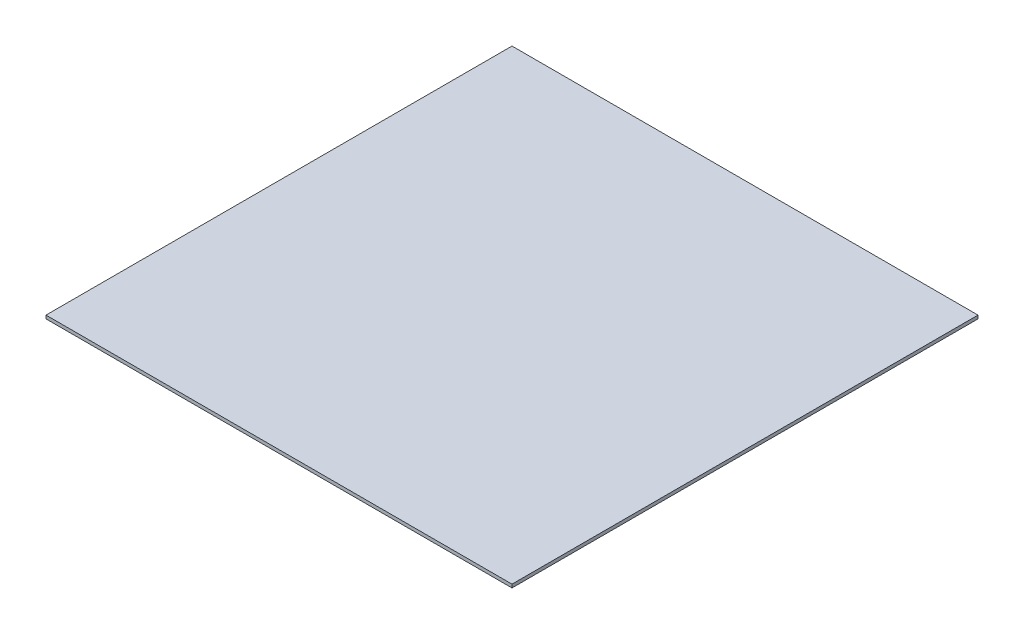
ISO-10303-21;
HEADER;
FILE_DESCRIPTION(('STEP AP214'),'2;1');
FILE_NAME('part.step','',(''),(''),'','','');
FILE_SCHEMA(('AUTOMOTIVE_DESIGN { 1 0 10303 214 1 1 1 1 }'));
ENDSEC;
DATA;
#1=APPLICATION_CONTEXT('core data for automotive mechanical design processes');
#2=APPLICATION_PROTOCOL_DEFINITION('international standard','automotive_design',2000,#1);
#3=PRODUCT_CONTEXT('',#1,'mechanical');
#4=PRODUCT('Part','Part','',(#3));
#5=PRODUCT_RELATED_PRODUCT_CATEGORY('part','',(#4));
#6=PRODUCT_DEFINITION_FORMATION('','',#4);
#7=PRODUCT_DEFINITION_CONTEXT('part definition',#1,'design');
#8=PRODUCT_DEFINITION('design','',#6,#7);
#9=PRODUCT_DEFINITION_SHAPE('','',#8);
#10=(LENGTH_UNIT() NAMED_UNIT(*) SI_UNIT(.MILLI.,.METRE.));
#11=(NAMED_UNIT(*) PLANE_ANGLE_UNIT() SI_UNIT($,.RADIAN.));
#12=(NAMED_UNIT(*) SI_UNIT($,.STERADIAN.) SOLID_ANGLE_UNIT());
#13=UNCERTAINTY_MEASURE_WITH_UNIT(LENGTH_MEASURE(1.E-05),#10,'distance_accuracy_value','');
#14=(GEOMETRIC_REPRESENTATION_CONTEXT(3) GLOBAL_UNCERTAINTY_ASSIGNED_CONTEXT((#13)) GLOBAL_UNIT_ASSIGNED_CONTEXT((#10,
#11,#12)) REPRESENTATION_CONTEXT('',''));
#15=CARTESIAN_POINT('',(0.,0.,0.));
#16=DIRECTION('',(0.,0.,1.));
#17=DIRECTION('',(1.,0.,0.));
#18=AXIS2_PLACEMENT_3D('',#15,#16,#17);
#19=CARTESIAN_POINT('',(26.7675000000001,0.5715,-26.7674999999999));
#20=DIRECTION('',(1.,0.,0.));
#21=DIRECTION('',(0.,0.,-1.));
#22=AXIS2_PLACEMENT_3D('',#19,#20,#21);
#23=PLANE('',#22);
#24=DIRECTION('',(0.,0.,1.));
#25=VECTOR('',#24,1.);
#26=CARTESIAN_POINT('',(26.7675000000001,0.1905,-26.7674999999999));
#27=LINE('',#26,#25);
#28=CARTESIAN_POINT('',(26.7675000000001,0.1905,-80.3024999999998));
#29=VERTEX_POINT('',#28);
#30=CARTESIAN_POINT('',(26.7675000000001,0.1905,-26.7674999999999));
#31=VERTEX_POINT('',#30);
#32=EDGE_CURVE('E98',#29,#31,#27,.T.);
#33=ORIENTED_EDGE('',*,*,#32,.T.);
#34=DIRECTION('',(0.,-1.,0.));
#35=VECTOR('',#34,1.);
#36=CARTESIAN_POINT('',(26.7675000000001,0.5715,-26.7674999999999));
#37=LINE('',#36,#35);
#38=CARTESIAN_POINT('',(26.7675000000001,0.5715,-26.7674999999999));
#39=VERTEX_POINT('',#38);
#40=EDGE_CURVE('E11',#39,#31,#37,.T.);
#41=ORIENTED_EDGE('',*,*,#40,.F.);
#42=DIRECTION('',(0.,0.,1.));
#43=VECTOR('',#42,1.);
#44=CARTESIAN_POINT('',(26.7675000000001,0.5715,-26.7674999999999));
#45=LINE('',#44,#43);
#46=CARTESIAN_POINT('',(26.7675000000001,0.5715,-80.3024999999998));
#47=VERTEX_POINT('',#46);
#48=EDGE_CURVE('E86',#47,#39,#45,.T.);
#49=ORIENTED_EDGE('',*,*,#48,.F.);
#50=DIRECTION('',(0.,-1.,0.));
#51=VECTOR('',#50,1.);
#52=CARTESIAN_POINT('',(26.7675000000001,0.5715,-80.3024999999998));
#53=LINE('',#52,#51);
#54=EDGE_CURVE('E94',#47,#29,#53,.T.);
#55=ORIENTED_EDGE('',*,*,#54,.T.);
#56=EDGE_LOOP('',(#33,#41,#49,#55));
#57=FACE_BOUND('',#56,.T.);
#58=ADVANCED_FACE('F35',(#57),#23,.F.);
#59=CARTESIAN_POINT('',(26.7675000000001,0.5715,-26.7674999999999));
#60=DIRECTION('',(0.,0.,-1.));
#61=DIRECTION('',(-1.,0.,0.));
#62=AXIS2_PLACEMENT_3D('',#59,#60,#61);
#63=PLANE('',#62);
#64=DIRECTION('',(1.,0.,0.));
#65=VECTOR('',#64,1.);
#66=CARTESIAN_POINT('',(26.7675000000001,0.1905,-26.7674999999999));
#67=LINE('',#66,#65);
#68=CARTESIAN_POINT('',(80.3025000000002,0.1905,-26.7674999999999));
#69=VERTEX_POINT('',#68);
#70=EDGE_CURVE('E90',#31,#69,#67,.T.);
#71=ORIENTED_EDGE('',*,*,#70,.T.);
#72=DIRECTION('',(0.,-1.,0.));
#73=VECTOR('',#72,1.);
#74=CARTESIAN_POINT('',(80.3025000000002,0.5715,-26.7674999999999));
#75=LINE('',#74,#73);
#76=CARTESIAN_POINT('',(80.3025000000002,0.5715,-26.7674999999999));
#77=VERTEX_POINT('',#76);
#78=EDGE_CURVE('E43',#77,#69,#75,.T.);
#79=ORIENTED_EDGE('',*,*,#78,.F.);
#80=DIRECTION('',(1.,0.,0.));
#81=VECTOR('',#80,1.);
#82=CARTESIAN_POINT('',(26.7675000000001,0.5715,-26.7674999999999));
#83=LINE('',#82,#81);
#84=EDGE_CURVE('E81',#39,#77,#83,.T.);
#85=ORIENTED_EDGE('',*,*,#84,.F.);
#86=ORIENTED_EDGE('',*,*,#40,.T.);
#87=EDGE_LOOP('',(#71,#79,#85,#86));
#88=FACE_BOUND('',#87,.T.);
#89=ADVANCED_FACE('F89',(#88),#63,.F.);
#90=CARTESIAN_POINT('',(80.3025000000002,0.5715,-80.3024999999998));
#91=DIRECTION('',(-1.,0.,0.));
#92=DIRECTION('',(0.,0.,1.));
#93=AXIS2_PLACEMENT_3D('',#90,#91,#92);
#94=PLANE('',#93);
#95=DIRECTION('',(0.,0.,-1.));
#96=VECTOR('',#95,1.);
#97=CARTESIAN_POINT('',(80.3025000000002,0.1905,-80.3024999999998));
#98=LINE('',#97,#96);
#99=CARTESIAN_POINT('',(80.3025000000002,0.1905,-80.3024999999998));
#100=VERTEX_POINT('',#99);
#101=EDGE_CURVE('E68',#69,#100,#98,.T.);
#102=ORIENTED_EDGE('',*,*,#101,.T.);
#103=DIRECTION('',(0.,-1.,0.));
#104=VECTOR('',#103,1.);
#105=CARTESIAN_POINT('',(80.3025000000002,0.5715,-80.3024999999998));
#106=LINE('',#105,#104);
#107=CARTESIAN_POINT('',(80.3025000000002,0.5715,-80.3024999999998));
#108=VERTEX_POINT('',#107);
#109=EDGE_CURVE('E91',#108,#100,#106,.T.);
#110=ORIENTED_EDGE('',*,*,#109,.F.);
#111=DIRECTION('',(0.,0.,-1.));
#112=VECTOR('',#111,1.);
#113=CARTESIAN_POINT('',(80.3025000000002,0.5715,-80.3024999999998));
#114=LINE('',#113,#112);
#115=EDGE_CURVE('E84',#77,#108,#114,.T.);
#116=ORIENTED_EDGE('',*,*,#115,.F.);
#117=ORIENTED_EDGE('',*,*,#78,.T.);
#118=EDGE_LOOP('',(#102,#110,#116,#117));
#119=FACE_BOUND('',#118,.T.);
#120=ADVANCED_FACE('F92',(#119),#94,.F.);
#121=CARTESIAN_POINT('',(26.7675000000001,0.5715,-80.3024999999998));
#122=DIRECTION('',(0.,0.,1.));
#123=DIRECTION('',(1.,0.,0.));
#124=AXIS2_PLACEMENT_3D('',#121,#122,#123);
#125=PLANE('',#124);
#126=DIRECTION('',(-1.,0.,0.));
#127=VECTOR('',#126,1.);
#128=CARTESIAN_POINT('',(26.7675000000001,0.1905,-80.3024999999998));
#129=LINE('',#128,#127);
#130=EDGE_CURVE('E74',#100,#29,#129,.T.);
#131=ORIENTED_EDGE('',*,*,#130,.T.);
#132=ORIENTED_EDGE('',*,*,#54,.F.);
#133=DIRECTION('',(-1.,0.,0.));
#134=VECTOR('',#133,1.);
#135=CARTESIAN_POINT('',(26.7675000000001,0.5715,-80.3024999999998));
#136=LINE('',#135,#134);
#137=EDGE_CURVE('E51',#108,#47,#136,.T.);
#138=ORIENTED_EDGE('',*,*,#137,.F.);
#139=ORIENTED_EDGE('',*,*,#109,.T.);
#140=EDGE_LOOP('',(#131,#132,#138,#139));
#141=FACE_BOUND('',#140,.T.);
#142=ADVANCED_FACE('F105',(#141),#125,.F.);
#143=CARTESIAN_POINT('',(26.7675000000001,0.5715,-26.7674999999999));
#144=DIRECTION('',(0.,-1.,0.));
#145=DIRECTION('',(0.,0.,-1.));
#146=AXIS2_PLACEMENT_3D('',#143,#144,#145);
#147=PLANE('',#146);
#148=ORIENTED_EDGE('',*,*,#48,.T.);
#149=ORIENTED_EDGE('',*,*,#84,.T.);
#150=ORIENTED_EDGE('',*,*,#115,.T.);
#151=ORIENTED_EDGE('',*,*,#137,.T.);
#152=EDGE_LOOP('',(#148,#149,#150,#151));
#153=FACE_BOUND('',#152,.T.);
#154=ADVANCED_FACE('F82',(#153),#147,.F.);
#155=CARTESIAN_POINT('',(26.7675000000001,0.1905,-26.7674999999999));
#156=DIRECTION('',(0.,-1.,0.));
#157=DIRECTION('',(0.,0.,-1.));
#158=AXIS2_PLACEMENT_3D('',#155,#156,#157);
#159=PLANE('',#158);
#160=ORIENTED_EDGE('',*,*,#32,.F.);
#161=ORIENTED_EDGE('',*,*,#130,.F.);
#162=ORIENTED_EDGE('',*,*,#101,.F.);
#163=ORIENTED_EDGE('',*,*,#70,.F.);
#164=EDGE_LOOP('',(#160,#161,#162,#163));
#165=FACE_BOUND('',#164,.T.);
#166=ADVANCED_FACE('F108',(#165),#159,.T.);
#167=CLOSED_SHELL('',(#58,#89,#120,#142,#154,#166));
#168=MANIFOLD_SOLID_BREP('B2',#167);
#169=ADVANCED_BREP_SHAPE_REPRESENTATION('',(#18,#168),#14);
#170=SHAPE_DEFINITION_REPRESENTATION(#9,#169);
ENDSEC;
END-ISO-10303-21;
